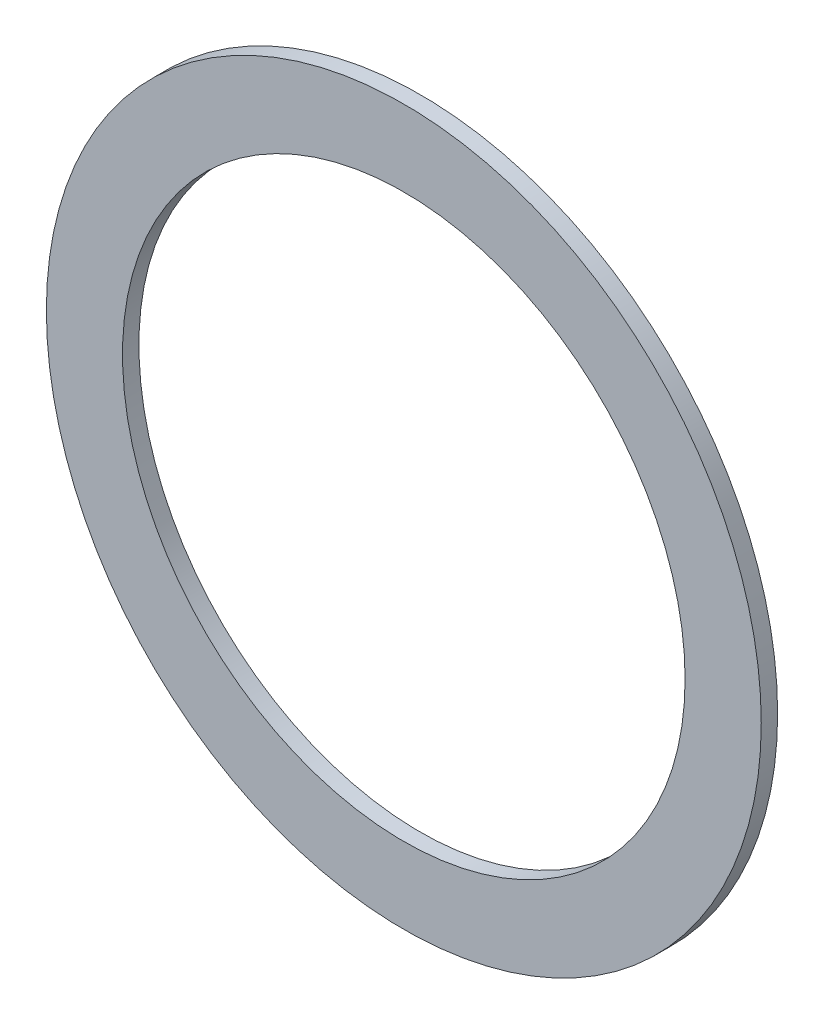
ISO-10303-21;
HEADER;
FILE_DESCRIPTION(('STEP AP214'),'2;1');
FILE_NAME('part.step','',(''),(''),'','','');
FILE_SCHEMA(('AUTOMOTIVE_DESIGN { 1 0 10303 214 1 1 1 1 }'));
ENDSEC;
DATA;
#1=APPLICATION_CONTEXT('core data for automotive mechanical design processes');
#2=APPLICATION_PROTOCOL_DEFINITION('international standard','automotive_design',2000,#1);
#3=PRODUCT_CONTEXT('',#1,'mechanical');
#4=PRODUCT('Part','Part','',(#3));
#5=PRODUCT_RELATED_PRODUCT_CATEGORY('part','',(#4));
#6=PRODUCT_DEFINITION_FORMATION('','',#4);
#7=PRODUCT_DEFINITION_CONTEXT('part definition',#1,'design');
#8=PRODUCT_DEFINITION('design','',#6,#7);
#9=PRODUCT_DEFINITION_SHAPE('','',#8);
#10=(LENGTH_UNIT() NAMED_UNIT(*) SI_UNIT(.MILLI.,.METRE.));
#11=(NAMED_UNIT(*) PLANE_ANGLE_UNIT() SI_UNIT($,.RADIAN.));
#12=(NAMED_UNIT(*) SI_UNIT($,.STERADIAN.) SOLID_ANGLE_UNIT());
#13=UNCERTAINTY_MEASURE_WITH_UNIT(LENGTH_MEASURE(1.E-05),#10,'distance_accuracy_value','');
#14=(GEOMETRIC_REPRESENTATION_CONTEXT(3) GLOBAL_UNCERTAINTY_ASSIGNED_CONTEXT((#13)) GLOBAL_UNIT_ASSIGNED_CONTEXT((#10,
#11,#12)) REPRESENTATION_CONTEXT('',''));
#15=CARTESIAN_POINT('',(0.,0.,0.));
#16=DIRECTION('',(0.,0.,1.));
#17=DIRECTION('',(1.,0.,0.));
#18=AXIS2_PLACEMENT_3D('',#15,#16,#17);
#19=CARTESIAN_POINT('',(0.,0.,0.508));
#20=DIRECTION('',(0.,0.,1.));
#21=DIRECTION('',(1.,0.,0.));
#22=AXIS2_PLACEMENT_3D('',#19,#20,#21);
#23=PLANE('',#22);
#24=CARTESIAN_POINT('',(0.,0.,0.508));
#25=DIRECTION('',(0.,0.,1.));
#26=DIRECTION('',(1.,0.,0.));
#27=AXIS2_PLACEMENT_3D('',#24,#25,#26);
#28=CIRCLE('',#27,11.0871);
#29=CARTESIAN_POINT('',(11.0871,0.,0.508));
#30=VERTEX_POINT('',#29);
#31=EDGE_CURVE('E10',#30,#30,#28,.T.);
#32=ORIENTED_EDGE('',*,*,#31,.T.);
#33=EDGE_LOOP('',(#32));
#34=FACE_BOUND('',#33,.T.);
#35=CARTESIAN_POINT('',(0.,0.,0.508));
#36=DIRECTION('',(0.,0.,1.));
#37=DIRECTION('',(1.,0.,0.));
#38=AXIS2_PLACEMENT_3D('',#35,#36,#37);
#39=CIRCLE('',#38,8.7249);
#40=CARTESIAN_POINT('',(8.7249,0.,0.508));
#41=VERTEX_POINT('',#40);
#42=EDGE_CURVE('E42',#41,#41,#39,.T.);
#43=ORIENTED_EDGE('',*,*,#42,.F.);
#44=EDGE_LOOP('',(#43));
#45=FACE_BOUND('',#44,.T.);
#46=ADVANCED_FACE('F31',(#34,#45),#23,.T.);
#47=CARTESIAN_POINT('',(0.,0.,0.));
#48=DIRECTION('',(0.,0.,1.));
#49=DIRECTION('',(1.,0.,0.));
#50=AXIS2_PLACEMENT_3D('',#47,#48,#49);
#51=PLANE('',#50);
#52=CARTESIAN_POINT('',(0.,0.,0.));
#53=DIRECTION('',(0.,0.,1.));
#54=DIRECTION('',(1.,0.,0.));
#55=AXIS2_PLACEMENT_3D('',#52,#53,#54);
#56=CIRCLE('',#55,11.0871);
#57=CARTESIAN_POINT('',(11.0871,0.,0.));
#58=VERTEX_POINT('',#57);
#59=EDGE_CURVE('E35',#58,#58,#56,.T.);
#60=ORIENTED_EDGE('',*,*,#59,.F.);
#61=EDGE_LOOP('',(#60));
#62=FACE_BOUND('',#61,.T.);
#63=CARTESIAN_POINT('',(0.,0.,0.));
#64=DIRECTION('',(0.,0.,1.));
#65=DIRECTION('',(1.,0.,0.));
#66=AXIS2_PLACEMENT_3D('',#63,#64,#65);
#67=CIRCLE('',#66,8.7249);
#68=CARTESIAN_POINT('',(8.7249,0.,0.));
#69=VERTEX_POINT('',#68);
#70=EDGE_CURVE('E44',#69,#69,#67,.T.);
#71=ORIENTED_EDGE('',*,*,#70,.T.);
#72=EDGE_LOOP('',(#71));
#73=FACE_BOUND('',#72,.T.);
#74=ADVANCED_FACE('F54',(#62,#73),#51,.F.);
#75=CARTESIAN_POINT('',(0.,0.,0.508));
#76=DIRECTION('',(0.,0.,-1.));
#77=DIRECTION('',(-1.,0.,0.));
#78=AXIS2_PLACEMENT_3D('',#75,#76,#77);
#79=CYLINDRICAL_SURFACE('',#78,11.0871);
#80=ORIENTED_EDGE('',*,*,#31,.F.);
#81=EDGE_LOOP('',(#80));
#82=FACE_BOUND('',#81,.T.);
#83=ORIENTED_EDGE('',*,*,#59,.T.);
#84=EDGE_LOOP('',(#83));
#85=FACE_BOUND('',#84,.T.);
#86=ADVANCED_FACE('F33',(#82,#85),#79,.T.);
#87=CARTESIAN_POINT('',(0.,0.,0.508));
#88=DIRECTION('',(0.,0.,-1.));
#89=DIRECTION('',(-1.,0.,0.));
#90=AXIS2_PLACEMENT_3D('',#87,#88,#89);
#91=CYLINDRICAL_SURFACE('',#90,8.7249);
#92=ORIENTED_EDGE('',*,*,#42,.T.);
#93=EDGE_LOOP('',(#92));
#94=FACE_BOUND('',#93,.T.);
#95=ORIENTED_EDGE('',*,*,#70,.F.);
#96=EDGE_LOOP('',(#95));
#97=FACE_BOUND('',#96,.T.);
#98=ADVANCED_FACE('F50',(#94,#97),#91,.F.);
#99=CLOSED_SHELL('',(#46,#74,#86,#98));
#100=MANIFOLD_SOLID_BREP('B2',#99);
#101=ADVANCED_BREP_SHAPE_REPRESENTATION('',(#18,#100),#14);
#102=SHAPE_DEFINITION_REPRESENTATION(#9,#101);
ENDSEC;
END-ISO-10303-21;
